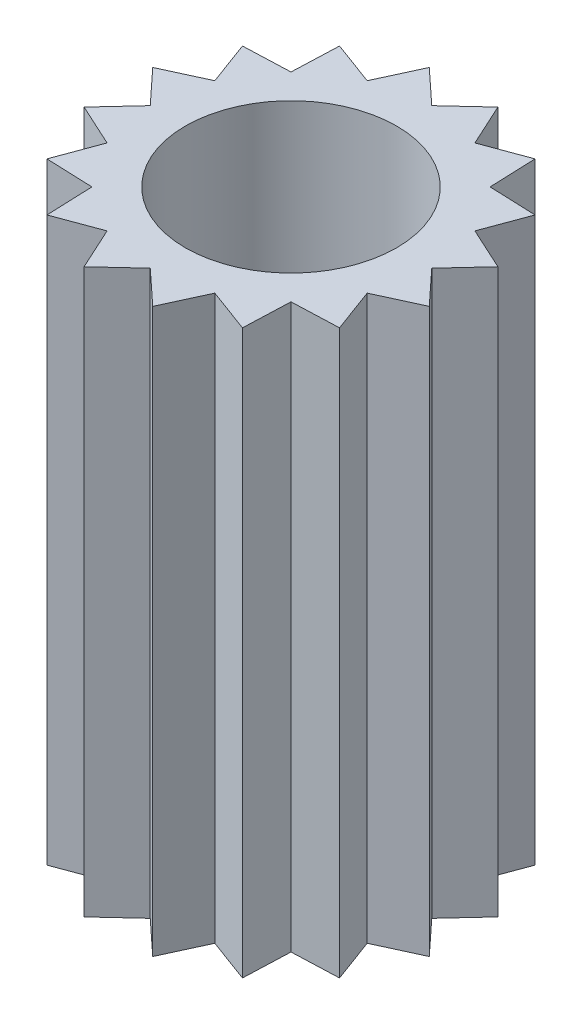
ISO-10303-21;
HEADER;
FILE_DESCRIPTION(('STEP AP214'),'2;1');
FILE_NAME('part.step','',(''),(''),'','','');
FILE_SCHEMA(('AUTOMOTIVE_DESIGN { 1 0 10303 214 1 1 1 1 }'));
ENDSEC;
DATA;
#1=APPLICATION_CONTEXT('core data for automotive mechanical design processes');
#2=APPLICATION_PROTOCOL_DEFINITION('international standard','automotive_design',2000,#1);
#3=PRODUCT_CONTEXT('',#1,'mechanical');
#4=PRODUCT('Part','Part','',(#3));
#5=PRODUCT_RELATED_PRODUCT_CATEGORY('part','',(#4));
#6=PRODUCT_DEFINITION_FORMATION('','',#4);
#7=PRODUCT_DEFINITION_CONTEXT('part definition',#1,'design');
#8=PRODUCT_DEFINITION('design','',#6,#7);
#9=PRODUCT_DEFINITION_SHAPE('','',#8);
#10=(LENGTH_UNIT() NAMED_UNIT(*) SI_UNIT(.MILLI.,.METRE.));
#11=(NAMED_UNIT(*) PLANE_ANGLE_UNIT() SI_UNIT($,.RADIAN.));
#12=(NAMED_UNIT(*) SI_UNIT($,.STERADIAN.) SOLID_ANGLE_UNIT());
#13=UNCERTAINTY_MEASURE_WITH_UNIT(LENGTH_MEASURE(1.E-05),#10,'distance_accuracy_value','');
#14=(GEOMETRIC_REPRESENTATION_CONTEXT(3) GLOBAL_UNCERTAINTY_ASSIGNED_CONTEXT((#13)) GLOBAL_UNIT_ASSIGNED_CONTEXT((#10,
#11,#12)) REPRESENTATION_CONTEXT('',''));
#15=CARTESIAN_POINT('',(0.,0.,0.));
#16=DIRECTION('',(0.,0.,1.));
#17=DIRECTION('',(1.,0.,0.));
#18=AXIS2_PLACEMENT_3D('',#15,#16,#17);
#19=CARTESIAN_POINT('',(0.,8.,0.));
#20=DIRECTION('',(0.,-1.,0.));
#21=DIRECTION('',(0.,0.,-1.));
#22=AXIS2_PLACEMENT_3D('',#19,#20,#21);
#23=PLANE('',#22);
#24=DIRECTION('',(-0.733486790032059,0.,-0.679703706660826));
#25=VECTOR('',#24,1.);
#26=CARTESIAN_POINT('',(-0.487725805040305,8.,-2.45196320100808));
#27=LINE('',#26,#25);
#28=CARTESIAN_POINT('',(0.,8.,-2.));
#29=VERTEX_POINT('',#28);
#30=CARTESIAN_POINT('',(-0.487725805040305,8.,-2.45196320100808));
#31=VERTEX_POINT('',#30);
#32=EDGE_CURVE('E340',#29,#31,#27,.T.);
#33=ORIENTED_EDGE('',*,*,#32,.T.);
#34=DIRECTION('',(-0.417542085221823,0.,0.908657585159895));
#35=VECTOR('',#34,1.);
#36=CARTESIAN_POINT('',(-0.765366864730182,8.,-1.84775906502257));
#37=LINE('',#36,#35);
#38=CARTESIAN_POINT('',(-0.765366864730182,8.,-1.84775906502257));
#39=VERTEX_POINT('',#38);
#40=EDGE_CURVE('E168',#31,#39,#37,.T.);
#41=ORIENTED_EDGE('',*,*,#40,.T.);
#42=DIRECTION('',(-0.937764780134276,0.,-0.347271100352033));
#43=VECTOR('',#42,1.);
#44=CARTESIAN_POINT('',(-1.38892558254902,8.,-2.07867403075635));
#45=LINE('',#44,#43);
#46=CARTESIAN_POINT('',(-1.38892558254902,8.,-2.07867403075635));
#47=VERTEX_POINT('',#46);
#48=EDGE_CURVE('E427',#39,#47,#45,.T.);
#49=ORIENTED_EDGE('',*,*,#48,.T.);
#50=DIRECTION('',(-0.0380303829649199,0.,0.999276583319924));
#51=VECTOR('',#50,1.);
#52=CARTESIAN_POINT('',(-1.4142135623731,8.,-1.41421356237309));
#53=LINE('',#52,#51);
#54=CARTESIAN_POINT('',(-1.4142135623731,8.,-1.41421356237309));
#55=VERTEX_POINT('',#54);
#56=EDGE_CURVE('E446',#47,#55,#53,.T.);
#57=ORIENTED_EDGE('',*,*,#56,.T.);
#58=DIRECTION('',(-0.999276583319923,0.,0.0380303829649601));
#59=VECTOR('',#58,1.);
#60=CARTESIAN_POINT('',(-2.07867403075638,8.,-1.38892558254899));
#61=LINE('',#60,#59);
#62=CARTESIAN_POINT('',(-2.07867403075638,8.,-1.38892558254899));
#63=VERTEX_POINT('',#62);
#64=EDGE_CURVE('E443',#55,#63,#61,.T.);
#65=ORIENTED_EDGE('',*,*,#64,.T.);
#66=DIRECTION('',(0.347271100352073,0.,0.937764780134262));
#67=VECTOR('',#66,1.);
#68=CARTESIAN_POINT('',(-1.84775906502258,8.,-0.765366864730179));
#69=LINE('',#68,#67);
#70=CARTESIAN_POINT('',(-1.84775906502258,8.,-0.765366864730179));
#71=VERTEX_POINT('',#70);
#72=EDGE_CURVE('E445',#63,#71,#69,.T.);
#73=ORIENTED_EDGE('',*,*,#72,.T.);
#74=DIRECTION('',(-0.908657585159895,0.,0.417542085221823));
#75=VECTOR('',#74,1.);
#76=CARTESIAN_POINT('',(-2.45196320100808,8.,-0.487725805040301));
#77=LINE('',#76,#75);
#78=CARTESIAN_POINT('',(-2.45196320100808,8.,-0.487725805040301));
#79=VERTEX_POINT('',#78);
#80=EDGE_CURVE('E448',#71,#79,#77,.T.);
#81=ORIENTED_EDGE('',*,*,#80,.T.);
#82=DIRECTION('',(0.679703706660826,0.,0.733486790032059));
#83=VECTOR('',#82,1.);
#84=CARTESIAN_POINT('',(-2.,8.,0.));
#85=LINE('',#84,#83);
#86=CARTESIAN_POINT('',(-2.,8.,0.));
#87=VERTEX_POINT('',#86);
#88=EDGE_CURVE('E454',#79,#87,#85,.T.);
#89=ORIENTED_EDGE('',*,*,#88,.T.);
#90=DIRECTION('',(-0.679703706660794,0.,0.733486790032088));
#91=VECTOR('',#90,1.);
#92=CARTESIAN_POINT('',(-2.45196320100808,8.,0.487725805040342));
#93=LINE('',#92,#91);
#94=CARTESIAN_POINT('',(-2.45196320100808,8.,0.487725805040342));
#95=VERTEX_POINT('',#94);
#96=EDGE_CURVE('E456',#87,#95,#93,.T.);
#97=ORIENTED_EDGE('',*,*,#96,.T.);
#98=DIRECTION('',(0.908657585159913,0.,0.417542085221783));
#99=VECTOR('',#98,1.);
#100=CARTESIAN_POINT('',(-1.84775906502258,8.,0.765366864730184));
#101=LINE('',#100,#99);
#102=CARTESIAN_POINT('',(-1.84775906502258,8.,0.765366864730184));
#103=VERTEX_POINT('',#102);
#104=EDGE_CURVE('E458',#95,#103,#101,.T.);
#105=ORIENTED_EDGE('',*,*,#104,.T.);
#106=DIRECTION('',(-0.347271100352034,0.,0.937764780134276));
#107=VECTOR('',#106,1.);
#108=CARTESIAN_POINT('',(-2.07867403075636,8.,1.38892558254902));
#109=LINE('',#108,#107);
#110=CARTESIAN_POINT('',(-2.07867403075636,8.,1.38892558254902));
#111=VERTEX_POINT('',#110);
#112=EDGE_CURVE('E460',#103,#111,#109,.T.);
#113=ORIENTED_EDGE('',*,*,#112,.T.);
#114=DIRECTION('',(0.999276583319924,0.,0.0380303829649199));
#115=VECTOR('',#114,1.);
#116=CARTESIAN_POINT('',(-1.4142135623731,8.,1.4142135623731));
#117=LINE('',#116,#115);
#118=CARTESIAN_POINT('',(-1.4142135623731,8.,1.4142135623731));
#119=VERTEX_POINT('',#118);
#120=EDGE_CURVE('E462',#111,#119,#117,.T.);
#121=ORIENTED_EDGE('',*,*,#120,.T.);
#122=DIRECTION('',(0.0380303829649621,0.,0.999276583319923));
#123=VECTOR('',#122,1.);
#124=CARTESIAN_POINT('',(-1.38892558254899,8.,2.07867403075638));
#125=LINE('',#124,#123);
#126=CARTESIAN_POINT('',(-1.38892558254899,8.,2.07867403075638));
#127=VERTEX_POINT('',#126);
#128=EDGE_CURVE('E464',#119,#127,#125,.T.);
#129=ORIENTED_EDGE('',*,*,#128,.T.);
#130=DIRECTION('',(0.937764780134262,0.,-0.347271100352073));
#131=VECTOR('',#130,1.);
#132=CARTESIAN_POINT('',(-0.765366864730182,8.,1.84775906502258));
#133=LINE('',#132,#131);
#134=CARTESIAN_POINT('',(-0.765366864730182,8.,1.84775906502258));
#135=VERTEX_POINT('',#134);
#136=EDGE_CURVE('E466',#127,#135,#133,.T.);
#137=ORIENTED_EDGE('',*,*,#136,.T.);
#138=DIRECTION('',(0.417542085221822,0.,0.908657585159896));
#139=VECTOR('',#138,1.);
#140=CARTESIAN_POINT('',(-0.487725805040306,8.,2.45196320100809));
#141=LINE('',#140,#139);
#142=CARTESIAN_POINT('',(-0.487725805040306,8.,2.45196320100809));
#143=VERTEX_POINT('',#142);
#144=EDGE_CURVE('E468',#135,#143,#141,.T.);
#145=ORIENTED_EDGE('',*,*,#144,.T.);
#146=DIRECTION('',(0.733486790032059,0.,-0.679703706660827));
#147=VECTOR('',#146,1.);
#148=CARTESIAN_POINT('',(0.,8.,2.00000000000001));
#149=LINE('',#148,#147);
#150=CARTESIAN_POINT('',(0.,8.,2.00000000000001));
#151=VERTEX_POINT('',#150);
#152=EDGE_CURVE('E470',#143,#151,#149,.T.);
#153=ORIENTED_EDGE('',*,*,#152,.T.);
#154=DIRECTION('',(0.733486790032087,0.,0.679703706660796));
#155=VECTOR('',#154,1.);
#156=CARTESIAN_POINT('',(0.487725805040337,8.,2.45196320100808));
#157=LINE('',#156,#155);
#158=CARTESIAN_POINT('',(0.487725805040337,8.,2.45196320100808));
#159=VERTEX_POINT('',#158);
#160=EDGE_CURVE('E472',#151,#159,#157,.T.);
#161=ORIENTED_EDGE('',*,*,#160,.T.);
#162=DIRECTION('',(0.417542085221784,0.,-0.908657585159913));
#163=VECTOR('',#162,1.);
#164=CARTESIAN_POINT('',(0.765366864730179,8.,1.84775906502258));
#165=LINE('',#164,#163);
#166=CARTESIAN_POINT('',(0.765366864730179,8.,1.84775906502258));
#167=VERTEX_POINT('',#166);
#168=EDGE_CURVE('E474',#159,#167,#165,.T.);
#169=ORIENTED_EDGE('',*,*,#168,.T.);
#170=DIRECTION('',(0.937764780134277,0.,0.347271100352033));
#171=VECTOR('',#170,1.);
#172=CARTESIAN_POINT('',(1.38892558254902,8.,2.07867403075636));
#173=LINE('',#172,#171);
#174=CARTESIAN_POINT('',(1.38892558254902,8.,2.07867403075636));
#175=VERTEX_POINT('',#174);
#176=EDGE_CURVE('E476',#167,#175,#173,.T.);
#177=ORIENTED_EDGE('',*,*,#176,.T.);
#178=DIRECTION('',(0.0380303829649199,0.,-0.999276583319924));
#179=VECTOR('',#178,1.);
#180=CARTESIAN_POINT('',(1.4142135623731,8.,1.4142135623731));
#181=LINE('',#180,#179);
#182=CARTESIAN_POINT('',(1.4142135623731,8.,1.4142135623731));
#183=VERTEX_POINT('',#182);
#184=EDGE_CURVE('E478',#175,#183,#181,.T.);
#185=ORIENTED_EDGE('',*,*,#184,.T.);
#186=DIRECTION('',(0.999276583319923,0.,-0.0380303829649618));
#187=VECTOR('',#186,1.);
#188=CARTESIAN_POINT('',(2.07867403075637,8.,1.388925582549));
#189=LINE('',#188,#187);
#190=CARTESIAN_POINT('',(2.07867403075637,8.,1.388925582549));
#191=VERTEX_POINT('',#190);
#192=EDGE_CURVE('E480',#183,#191,#189,.T.);
#193=ORIENTED_EDGE('',*,*,#192,.T.);
#194=DIRECTION('',(-0.347271100352073,0.,-0.937764780134262));
#195=VECTOR('',#194,1.);
#196=CARTESIAN_POINT('',(1.84775906502258,8.,0.765366864730185));
#197=LINE('',#196,#195);
#198=CARTESIAN_POINT('',(1.84775906502258,8.,0.765366864730185));
#199=VERTEX_POINT('',#198);
#200=EDGE_CURVE('E482',#191,#199,#197,.T.);
#201=ORIENTED_EDGE('',*,*,#200,.T.);
#202=DIRECTION('',(0.908657585159896,0.,-0.417542085221822));
#203=VECTOR('',#202,1.);
#204=CARTESIAN_POINT('',(2.45196320100808,8.,0.487725805040308));
#205=LINE('',#204,#203);
#206=CARTESIAN_POINT('',(2.45196320100808,8.,0.487725805040308));
#207=VERTEX_POINT('',#206);
#208=EDGE_CURVE('E484',#199,#207,#205,.T.);
#209=ORIENTED_EDGE('',*,*,#208,.T.);
#210=DIRECTION('',(-0.679703706660827,0.,-0.733486790032059));
#211=VECTOR('',#210,1.);
#212=CARTESIAN_POINT('',(2.,8.,0.));
#213=LINE('',#212,#211);
#214=CARTESIAN_POINT('',(2.,8.,0.));
#215=VERTEX_POINT('',#214);
#216=EDGE_CURVE('E486',#207,#215,#213,.T.);
#217=ORIENTED_EDGE('',*,*,#216,.T.);
#218=DIRECTION('',(0.679703706660795,0.,-0.733486790032087));
#219=VECTOR('',#218,1.);
#220=CARTESIAN_POINT('',(2.45196320100808,8.,-0.487725805040334));
#221=LINE('',#220,#219);
#222=CARTESIAN_POINT('',(2.45196320100808,8.,-0.487725805040334));
#223=VERTEX_POINT('',#222);
#224=EDGE_CURVE('E488',#215,#223,#221,.T.);
#225=ORIENTED_EDGE('',*,*,#224,.T.);
#226=DIRECTION('',(-0.908657585159913,0.,-0.417542085221784));
#227=VECTOR('',#226,1.);
#228=CARTESIAN_POINT('',(1.84775906502258,8.,-0.765366864730177));
#229=LINE('',#228,#227);
#230=CARTESIAN_POINT('',(1.84775906502258,8.,-0.765366864730177));
#231=VERTEX_POINT('',#230);
#232=EDGE_CURVE('E490',#223,#231,#229,.T.);
#233=ORIENTED_EDGE('',*,*,#232,.T.);
#234=DIRECTION('',(0.347271100352034,0.,-0.937764780134276));
#235=VECTOR('',#234,1.);
#236=CARTESIAN_POINT('',(2.07867403075636,8.,-1.38892558254902));
#237=LINE('',#236,#235);
#238=CARTESIAN_POINT('',(2.07867403075636,8.,-1.38892558254902));
#239=VERTEX_POINT('',#238);
#240=EDGE_CURVE('E492',#231,#239,#237,.T.);
#241=ORIENTED_EDGE('',*,*,#240,.T.);
#242=DIRECTION('',(-0.999276583319924,0.,-0.0380303829649199));
#243=VECTOR('',#242,1.);
#244=CARTESIAN_POINT('',(1.4142135623731,8.,-1.41421356237309));
#245=LINE('',#244,#243);
#246=CARTESIAN_POINT('',(1.4142135623731,8.,-1.41421356237309));
#247=VERTEX_POINT('',#246);
#248=EDGE_CURVE('E494',#239,#247,#245,.T.);
#249=ORIENTED_EDGE('',*,*,#248,.T.);
#250=DIRECTION('',(-0.0380303829649624,0.,-0.999276583319923));
#251=VECTOR('',#250,1.);
#252=CARTESIAN_POINT('',(1.38892558254899,8.,-2.07867403075637));
#253=LINE('',#252,#251);
#254=CARTESIAN_POINT('',(1.38892558254899,8.,-2.07867403075637));
#255=VERTEX_POINT('',#254);
#256=EDGE_CURVE('E259',#247,#255,#253,.T.);
#257=ORIENTED_EDGE('',*,*,#256,.T.);
#258=DIRECTION('',(-0.937764780134262,0.,0.347271100352073));
#259=VECTOR('',#258,1.);
#260=CARTESIAN_POINT('',(0.765366864730181,8.,-1.84775906502257));
#261=LINE('',#260,#259);
#262=CARTESIAN_POINT('',(0.765366864730181,8.,-1.84775906502257));
#263=VERTEX_POINT('',#262);
#264=EDGE_CURVE('E253',#255,#263,#261,.T.);
#265=ORIENTED_EDGE('',*,*,#264,.T.);
#266=DIRECTION('',(-0.417542085221823,0.,-0.908657585159895));
#267=VECTOR('',#266,1.);
#268=CARTESIAN_POINT('',(0.487725805040303,8.,-2.45196320100808));
#269=LINE('',#268,#267);
#270=CARTESIAN_POINT('',(0.487725805040303,8.,-2.45196320100808));
#271=VERTEX_POINT('',#270);
#272=EDGE_CURVE('E257',#263,#271,#269,.T.);
#273=ORIENTED_EDGE('',*,*,#272,.T.);
#274=DIRECTION('',(-0.733486790032058,0.,0.679703706660827));
#275=VECTOR('',#274,1.);
#276=CARTESIAN_POINT('',(0.,8.,-2.));
#277=LINE('',#276,#275);
#278=EDGE_CURVE('E53',#271,#29,#277,.T.);
#279=ORIENTED_EDGE('',*,*,#278,.T.);
#280=EDGE_LOOP('',(#33,#41,#49,#57,#65,#73,#81,#89,#97,#105,#113,#121,#129,#137,#145,#153,#161,
#169,#177,#185,#193,#201,#209,#217,#225,#233,#241,#249,#257,#265,#273,#279));
#281=FACE_BOUND('',#280,.T.);
#282=CARTESIAN_POINT('',(0.,8.,0.));
#283=DIRECTION('',(0.,1.,0.));
#284=DIRECTION('',(0.,0.,1.));
#285=AXIS2_PLACEMENT_3D('',#282,#283,#284);
#286=CIRCLE('',#285,1.5);
#287=CARTESIAN_POINT('',(0.,8.,1.5));
#288=VERTEX_POINT('',#287);
#289=EDGE_CURVE('E281',#288,#288,#286,.T.);
#290=ORIENTED_EDGE('',*,*,#289,.F.);
#291=EDGE_LOOP('',(#290));
#292=FACE_BOUND('',#291,.T.);
#293=ADVANCED_FACE('F36',(#281,#292),#23,.F.);
#294=CARTESIAN_POINT('',(0.,0.,0.));
#295=DIRECTION('',(0.,-1.,0.));
#296=DIRECTION('',(0.,0.,-1.));
#297=AXIS2_PLACEMENT_3D('',#294,#295,#296);
#298=PLANE('',#297);
#299=DIRECTION('',(-0.733486790032059,0.,-0.679703706660826));
#300=VECTOR('',#299,1.);
#301=CARTESIAN_POINT('',(-0.487725805040305,0.,-2.45196320100808));
#302=LINE('',#301,#300);
#303=CARTESIAN_POINT('',(0.,0.,-2.));
#304=VERTEX_POINT('',#303);
#305=CARTESIAN_POINT('',(-0.487725805040305,0.,-2.45196320100808));
#306=VERTEX_POINT('',#305);
#307=EDGE_CURVE('E277',#304,#306,#302,.T.);
#308=ORIENTED_EDGE('',*,*,#307,.F.);
#309=DIRECTION('',(-0.733486790032058,0.,0.679703706660827));
#310=VECTOR('',#309,1.);
#311=CARTESIAN_POINT('',(0.,0.,-2.));
#312=LINE('',#311,#310);
#313=CARTESIAN_POINT('',(0.487725805040303,0.,-2.45196320100808));
#314=VERTEX_POINT('',#313);
#315=EDGE_CURVE('E160',#314,#304,#312,.T.);
#316=ORIENTED_EDGE('',*,*,#315,.F.);
#317=DIRECTION('',(-0.417542085221823,0.,-0.908657585159895));
#318=VECTOR('',#317,1.);
#319=CARTESIAN_POINT('',(0.487725805040303,0.,-2.45196320100808));
#320=LINE('',#319,#318);
#321=CARTESIAN_POINT('',(0.765366864730181,0.,-1.84775906502257));
#322=VERTEX_POINT('',#321);
#323=EDGE_CURVE('E154',#322,#314,#320,.T.);
#324=ORIENTED_EDGE('',*,*,#323,.F.);
#325=DIRECTION('',(-0.937764780134262,0.,0.347271100352073));
#326=VECTOR('',#325,1.);
#327=CARTESIAN_POINT('',(0.765366864730181,0.,-1.84775906502257));
#328=LINE('',#327,#326);
#329=CARTESIAN_POINT('',(1.38892558254899,0.,-2.07867403075637));
#330=VERTEX_POINT('',#329);
#331=EDGE_CURVE('E267',#330,#322,#328,.T.);
#332=ORIENTED_EDGE('',*,*,#331,.F.);
#333=DIRECTION('',(-0.0380303829649624,0.,-0.999276583319923));
#334=VECTOR('',#333,1.);
#335=CARTESIAN_POINT('',(1.38892558254899,0.,-2.07867403075637));
#336=LINE('',#335,#334);
#337=CARTESIAN_POINT('',(1.4142135623731,0.,-1.41421356237309));
#338=VERTEX_POINT('',#337);
#339=EDGE_CURVE('E335',#338,#330,#336,.T.);
#340=ORIENTED_EDGE('',*,*,#339,.F.);
#341=DIRECTION('',(-0.999276583319924,0.,-0.0380303829649199));
#342=VECTOR('',#341,1.);
#343=CARTESIAN_POINT('',(1.4142135623731,0.,-1.41421356237309));
#344=LINE('',#343,#342);
#345=CARTESIAN_POINT('',(2.07867403075636,0.,-1.38892558254902));
#346=VERTEX_POINT('',#345);
#347=EDGE_CURVE('E333',#346,#338,#344,.T.);
#348=ORIENTED_EDGE('',*,*,#347,.F.);
#349=DIRECTION('',(0.347271100352034,0.,-0.937764780134276));
#350=VECTOR('',#349,1.);
#351=CARTESIAN_POINT('',(2.07867403075636,0.,-1.38892558254902));
#352=LINE('',#351,#350);
#353=CARTESIAN_POINT('',(1.84775906502258,0.,-0.765366864730177));
#354=VERTEX_POINT('',#353);
#355=EDGE_CURVE('E331',#354,#346,#352,.T.);
#356=ORIENTED_EDGE('',*,*,#355,.F.);
#357=DIRECTION('',(-0.908657585159913,0.,-0.417542085221784));
#358=VECTOR('',#357,1.);
#359=CARTESIAN_POINT('',(1.84775906502258,0.,-0.765366864730177));
#360=LINE('',#359,#358);
#361=CARTESIAN_POINT('',(2.45196320100808,0.,-0.487725805040334));
#362=VERTEX_POINT('',#361);
#363=EDGE_CURVE('E329',#362,#354,#360,.T.);
#364=ORIENTED_EDGE('',*,*,#363,.F.);
#365=DIRECTION('',(0.679703706660795,0.,-0.733486790032087));
#366=VECTOR('',#365,1.);
#367=CARTESIAN_POINT('',(2.45196320100808,0.,-0.487725805040334));
#368=LINE('',#367,#366);
#369=CARTESIAN_POINT('',(2.,0.,0.));
#370=VERTEX_POINT('',#369);
#371=EDGE_CURVE('E327',#370,#362,#368,.T.);
#372=ORIENTED_EDGE('',*,*,#371,.F.);
#373=DIRECTION('',(-0.679703706660827,0.,-0.733486790032059));
#374=VECTOR('',#373,1.);
#375=CARTESIAN_POINT('',(2.,0.,0.));
#376=LINE('',#375,#374);
#377=CARTESIAN_POINT('',(2.45196320100808,0.,0.487725805040308));
#378=VERTEX_POINT('',#377);
#379=EDGE_CURVE('E325',#378,#370,#376,.T.);
#380=ORIENTED_EDGE('',*,*,#379,.F.);
#381=DIRECTION('',(0.908657585159896,0.,-0.417542085221822));
#382=VECTOR('',#381,1.);
#383=CARTESIAN_POINT('',(2.45196320100808,0.,0.487725805040308));
#384=LINE('',#383,#382);
#385=CARTESIAN_POINT('',(1.84775906502258,0.,0.765366864730185));
#386=VERTEX_POINT('',#385);
#387=EDGE_CURVE('E323',#386,#378,#384,.T.);
#388=ORIENTED_EDGE('',*,*,#387,.F.);
#389=DIRECTION('',(-0.347271100352073,0.,-0.937764780134262));
#390=VECTOR('',#389,1.);
#391=CARTESIAN_POINT('',(1.84775906502258,0.,0.765366864730185));
#392=LINE('',#391,#390);
#393=CARTESIAN_POINT('',(2.07867403075637,0.,1.388925582549));
#394=VERTEX_POINT('',#393);
#395=EDGE_CURVE('E321',#394,#386,#392,.T.);
#396=ORIENTED_EDGE('',*,*,#395,.F.);
#397=DIRECTION('',(0.999276583319923,0.,-0.0380303829649618));
#398=VECTOR('',#397,1.);
#399=CARTESIAN_POINT('',(2.07867403075637,0.,1.388925582549));
#400=LINE('',#399,#398);
#401=CARTESIAN_POINT('',(1.4142135623731,0.,1.4142135623731));
#402=VERTEX_POINT('',#401);
#403=EDGE_CURVE('E319',#402,#394,#400,.T.);
#404=ORIENTED_EDGE('',*,*,#403,.F.);
#405=DIRECTION('',(0.0380303829649199,0.,-0.999276583319924));
#406=VECTOR('',#405,1.);
#407=CARTESIAN_POINT('',(1.4142135623731,0.,1.4142135623731));
#408=LINE('',#407,#406);
#409=CARTESIAN_POINT('',(1.38892558254902,0.,2.07867403075636));
#410=VERTEX_POINT('',#409);
#411=EDGE_CURVE('E317',#410,#402,#408,.T.);
#412=ORIENTED_EDGE('',*,*,#411,.F.);
#413=DIRECTION('',(0.937764780134277,0.,0.347271100352033));
#414=VECTOR('',#413,1.);
#415=CARTESIAN_POINT('',(1.38892558254902,0.,2.07867403075636));
#416=LINE('',#415,#414);
#417=CARTESIAN_POINT('',(0.765366864730179,0.,1.84775906502258));
#418=VERTEX_POINT('',#417);
#419=EDGE_CURVE('E315',#418,#410,#416,.T.);
#420=ORIENTED_EDGE('',*,*,#419,.F.);
#421=DIRECTION('',(0.417542085221784,0.,-0.908657585159913));
#422=VECTOR('',#421,1.);
#423=CARTESIAN_POINT('',(0.765366864730179,0.,1.84775906502258));
#424=LINE('',#423,#422);
#425=CARTESIAN_POINT('',(0.487725805040337,0.,2.45196320100808));
#426=VERTEX_POINT('',#425);
#427=EDGE_CURVE('E313',#426,#418,#424,.T.);
#428=ORIENTED_EDGE('',*,*,#427,.F.);
#429=DIRECTION('',(0.733486790032087,0.,0.679703706660796));
#430=VECTOR('',#429,1.);
#431=CARTESIAN_POINT('',(0.487725805040337,0.,2.45196320100808));
#432=LINE('',#431,#430);
#433=CARTESIAN_POINT('',(0.,0.,2.00000000000001));
#434=VERTEX_POINT('',#433);
#435=EDGE_CURVE('E311',#434,#426,#432,.T.);
#436=ORIENTED_EDGE('',*,*,#435,.F.);
#437=DIRECTION('',(0.733486790032059,0.,-0.679703706660827));
#438=VECTOR('',#437,1.);
#439=CARTESIAN_POINT('',(0.,0.,2.00000000000001));
#440=LINE('',#439,#438);
#441=CARTESIAN_POINT('',(-0.487725805040306,0.,2.45196320100809));
#442=VERTEX_POINT('',#441);
#443=EDGE_CURVE('E309',#442,#434,#440,.T.);
#444=ORIENTED_EDGE('',*,*,#443,.F.);
#445=DIRECTION('',(0.417542085221822,0.,0.908657585159896));
#446=VECTOR('',#445,1.);
#447=CARTESIAN_POINT('',(-0.487725805040306,0.,2.45196320100809));
#448=LINE('',#447,#446);
#449=CARTESIAN_POINT('',(-0.765366864730182,0.,1.84775906502258));
#450=VERTEX_POINT('',#449);
#451=EDGE_CURVE('E307',#450,#442,#448,.T.);
#452=ORIENTED_EDGE('',*,*,#451,.F.);
#453=DIRECTION('',(0.937764780134262,0.,-0.347271100352073));
#454=VECTOR('',#453,1.);
#455=CARTESIAN_POINT('',(-0.765366864730182,0.,1.84775906502258));
#456=LINE('',#455,#454);
#457=CARTESIAN_POINT('',(-1.38892558254899,0.,2.07867403075638));
#458=VERTEX_POINT('',#457);
#459=EDGE_CURVE('E305',#458,#450,#456,.T.);
#460=ORIENTED_EDGE('',*,*,#459,.F.);
#461=DIRECTION('',(0.0380303829649621,0.,0.999276583319923));
#462=VECTOR('',#461,1.);
#463=CARTESIAN_POINT('',(-1.38892558254899,0.,2.07867403075638));
#464=LINE('',#463,#462);
#465=CARTESIAN_POINT('',(-1.4142135623731,0.,1.4142135623731));
#466=VERTEX_POINT('',#465);
#467=EDGE_CURVE('E303',#466,#458,#464,.T.);
#468=ORIENTED_EDGE('',*,*,#467,.F.);
#469=DIRECTION('',(0.999276583319924,0.,0.0380303829649199));
#470=VECTOR('',#469,1.);
#471=CARTESIAN_POINT('',(-1.4142135623731,0.,1.4142135623731));
#472=LINE('',#471,#470);
#473=CARTESIAN_POINT('',(-2.07867403075636,0.,1.38892558254902));
#474=VERTEX_POINT('',#473);
#475=EDGE_CURVE('E301',#474,#466,#472,.T.);
#476=ORIENTED_EDGE('',*,*,#475,.F.);
#477=DIRECTION('',(-0.347271100352034,0.,0.937764780134276));
#478=VECTOR('',#477,1.);
#479=CARTESIAN_POINT('',(-2.07867403075636,0.,1.38892558254902));
#480=LINE('',#479,#478);
#481=CARTESIAN_POINT('',(-1.84775906502258,0.,0.765366864730184));
#482=VERTEX_POINT('',#481);
#483=EDGE_CURVE('E299',#482,#474,#480,.T.);
#484=ORIENTED_EDGE('',*,*,#483,.F.);
#485=DIRECTION('',(0.908657585159913,0.,0.417542085221783));
#486=VECTOR('',#485,1.);
#487=CARTESIAN_POINT('',(-1.84775906502258,0.,0.765366864730184));
#488=LINE('',#487,#486);
#489=CARTESIAN_POINT('',(-2.45196320100808,0.,0.487725805040342));
#490=VERTEX_POINT('',#489);
#491=EDGE_CURVE('E297',#490,#482,#488,.T.);
#492=ORIENTED_EDGE('',*,*,#491,.F.);
#493=DIRECTION('',(-0.679703706660794,0.,0.733486790032088));
#494=VECTOR('',#493,1.);
#495=CARTESIAN_POINT('',(-2.45196320100808,0.,0.487725805040342));
#496=LINE('',#495,#494);
#497=CARTESIAN_POINT('',(-2.,0.,0.));
#498=VERTEX_POINT('',#497);
#499=EDGE_CURVE('E295',#498,#490,#496,.T.);
#500=ORIENTED_EDGE('',*,*,#499,.F.);
#501=DIRECTION('',(0.679703706660826,0.,0.733486790032059));
#502=VECTOR('',#501,1.);
#503=CARTESIAN_POINT('',(-2.,0.,0.));
#504=LINE('',#503,#502);
#505=CARTESIAN_POINT('',(-2.45196320100808,0.,-0.487725805040301));
#506=VERTEX_POINT('',#505);
#507=EDGE_CURVE('E293',#506,#498,#504,.T.);
#508=ORIENTED_EDGE('',*,*,#507,.F.);
#509=DIRECTION('',(-0.908657585159895,0.,0.417542085221823));
#510=VECTOR('',#509,1.);
#511=CARTESIAN_POINT('',(-2.45196320100808,0.,-0.487725805040301));
#512=LINE('',#511,#510);
#513=CARTESIAN_POINT('',(-1.84775906502258,0.,-0.765366864730179));
#514=VERTEX_POINT('',#513);
#515=EDGE_CURVE('E291',#514,#506,#512,.T.);
#516=ORIENTED_EDGE('',*,*,#515,.F.);
#517=DIRECTION('',(0.347271100352073,0.,0.937764780134262));
#518=VECTOR('',#517,1.);
#519=CARTESIAN_POINT('',(-1.84775906502258,0.,-0.765366864730179));
#520=LINE('',#519,#518);
#521=CARTESIAN_POINT('',(-2.07867403075638,0.,-1.38892558254899));
#522=VERTEX_POINT('',#521);
#523=EDGE_CURVE('E289',#522,#514,#520,.T.);
#524=ORIENTED_EDGE('',*,*,#523,.F.);
#525=DIRECTION('',(-0.999276583319923,0.,0.0380303829649601));
#526=VECTOR('',#525,1.);
#527=CARTESIAN_POINT('',(-2.07867403075638,0.,-1.38892558254899));
#528=LINE('',#527,#526);
#529=CARTESIAN_POINT('',(-1.4142135623731,0.,-1.41421356237309));
#530=VERTEX_POINT('',#529);
#531=EDGE_CURVE('E287',#530,#522,#528,.T.);
#532=ORIENTED_EDGE('',*,*,#531,.F.);
#533=DIRECTION('',(-0.0380303829649199,0.,0.999276583319924));
#534=VECTOR('',#533,1.);
#535=CARTESIAN_POINT('',(-1.4142135623731,0.,-1.41421356237309));
#536=LINE('',#535,#534);
#537=CARTESIAN_POINT('',(-1.38892558254902,0.,-2.07867403075635));
#538=VERTEX_POINT('',#537);
#539=EDGE_CURVE('E285',#538,#530,#536,.T.);
#540=ORIENTED_EDGE('',*,*,#539,.F.);
#541=DIRECTION('',(-0.937764780134276,0.,-0.347271100352033));
#542=VECTOR('',#541,1.);
#543=CARTESIAN_POINT('',(-1.38892558254902,0.,-2.07867403075635));
#544=LINE('',#543,#542);
#545=CARTESIAN_POINT('',(-0.765366864730182,0.,-1.84775906502257));
#546=VERTEX_POINT('',#545);
#547=EDGE_CURVE('E283',#546,#538,#544,.T.);
#548=ORIENTED_EDGE('',*,*,#547,.F.);
#549=DIRECTION('',(-0.417542085221823,0.,0.908657585159895));
#550=VECTOR('',#549,1.);
#551=CARTESIAN_POINT('',(-0.765366864730182,0.,-1.84775906502257));
#552=LINE('',#551,#550);
#553=EDGE_CURVE('E280',#306,#546,#552,.T.);
#554=ORIENTED_EDGE('',*,*,#553,.F.);
#555=EDGE_LOOP('',(#308,#316,#324,#332,#340,#348,#356,#364,#372,#380,#388,#396,#404,#412,#420,
#428,#436,#444,#452,#460,#468,#476,#484,#492,#500,#508,#516,#524,#532,#540,#548,#554));
#556=FACE_BOUND('',#555,.T.);
#557=CARTESIAN_POINT('',(0.,0.,0.));
#558=DIRECTION('',(0.,1.,0.));
#559=DIRECTION('',(0.,0.,1.));
#560=AXIS2_PLACEMENT_3D('',#557,#558,#559);
#561=CIRCLE('',#560,1.5);
#562=CARTESIAN_POINT('',(0.,0.,1.5));
#563=VERTEX_POINT('',#562);
#564=EDGE_CURVE('E901',#563,#563,#561,.T.);
#565=ORIENTED_EDGE('',*,*,#564,.T.);
#566=EDGE_LOOP('',(#565));
#567=FACE_BOUND('',#566,.T.);
#568=ADVANCED_FACE('F431',(#556,#567),#298,.T.);
#569=CARTESIAN_POINT('',(-0.487725805040305,8.,-2.45196320100808));
#570=DIRECTION('',(-0.679703706660826,0.,0.733486790032059));
#571=DIRECTION('',(0.733486790032059,0.,0.679703706660826));
#572=AXIS2_PLACEMENT_3D('',#569,#570,#571);
#573=PLANE('',#572);
#574=ORIENTED_EDGE('',*,*,#307,.T.);
#575=DIRECTION('',(0.,-1.,0.));
#576=VECTOR('',#575,1.);
#577=CARTESIAN_POINT('',(-0.487725805040305,8.,-2.45196320100808));
#578=LINE('',#577,#576);
#579=EDGE_CURVE('E11',#31,#306,#578,.T.);
#580=ORIENTED_EDGE('',*,*,#579,.F.);
#581=ORIENTED_EDGE('',*,*,#32,.F.);
#582=DIRECTION('',(0.,-1.,0.));
#583=VECTOR('',#582,1.);
#584=CARTESIAN_POINT('',(0.,8.,-2.));
#585=LINE('',#584,#583);
#586=EDGE_CURVE('E273',#29,#304,#585,.T.);
#587=ORIENTED_EDGE('',*,*,#586,.T.);
#588=EDGE_LOOP('',(#574,#580,#581,#587));
#589=FACE_BOUND('',#588,.T.);
#590=ADVANCED_FACE('F38',(#589),#573,.F.);
#591=CARTESIAN_POINT('',(-0.765366864730182,8.,-1.84775906502257));
#592=DIRECTION('',(0.908657585159895,0.,0.417542085221823));
#593=DIRECTION('',(0.417542085221823,0.,-0.908657585159895));
#594=AXIS2_PLACEMENT_3D('',#591,#592,#593);
#595=PLANE('',#594);
#596=ORIENTED_EDGE('',*,*,#553,.T.);
#597=DIRECTION('',(0.,-1.,0.));
#598=VECTOR('',#597,1.);
#599=CARTESIAN_POINT('',(-0.765366864730182,8.,-1.84775906502257));
#600=LINE('',#599,#598);
#601=EDGE_CURVE('E45',#39,#546,#600,.T.);
#602=ORIENTED_EDGE('',*,*,#601,.F.);
#603=ORIENTED_EDGE('',*,*,#40,.F.);
#604=ORIENTED_EDGE('',*,*,#579,.T.);
#605=EDGE_LOOP('',(#596,#602,#603,#604));
#606=FACE_BOUND('',#605,.T.);
#607=ADVANCED_FACE('F528',(#606),#595,.F.);
#608=CARTESIAN_POINT('',(-1.38892558254902,8.,-2.07867403075635));
#609=DIRECTION('',(-0.347271100352033,0.,0.937764780134277));
#610=DIRECTION('',(0.937764780134277,0.,0.347271100352033));
#611=AXIS2_PLACEMENT_3D('',#608,#609,#610);
#612=PLANE('',#611);
#613=ORIENTED_EDGE('',*,*,#547,.T.);
#614=DIRECTION('',(0.,-1.,0.));
#615=VECTOR('',#614,1.);
#616=CARTESIAN_POINT('',(-1.38892558254902,8.,-2.07867403075635));
#617=LINE('',#616,#615);
#618=EDGE_CURVE('E419',#47,#538,#617,.T.);
#619=ORIENTED_EDGE('',*,*,#618,.F.);
#620=ORIENTED_EDGE('',*,*,#48,.F.);
#621=ORIENTED_EDGE('',*,*,#601,.T.);
#622=EDGE_LOOP('',(#613,#619,#620,#621));
#623=FACE_BOUND('',#622,.T.);
#624=ADVANCED_FACE('F425',(#623),#612,.F.);
#625=CARTESIAN_POINT('',(-1.4142135623731,8.,-1.41421356237309));
#626=DIRECTION('',(0.999276583319924,0.,0.0380303829649199));
#627=DIRECTION('',(0.0380303829649199,0.,-0.999276583319924));
#628=AXIS2_PLACEMENT_3D('',#625,#626,#627);
#629=PLANE('',#628);
#630=ORIENTED_EDGE('',*,*,#539,.T.);
#631=DIRECTION('',(0.,-1.,0.));
#632=VECTOR('',#631,1.);
#633=CARTESIAN_POINT('',(-1.4142135623731,8.,-1.41421356237309));
#634=LINE('',#633,#632);
#635=EDGE_CURVE('E416',#55,#530,#634,.T.);
#636=ORIENTED_EDGE('',*,*,#635,.F.);
#637=ORIENTED_EDGE('',*,*,#56,.F.);
#638=ORIENTED_EDGE('',*,*,#618,.T.);
#639=EDGE_LOOP('',(#630,#636,#637,#638));
#640=FACE_BOUND('',#639,.T.);
#641=ADVANCED_FACE('F437',(#640),#629,.F.);
#642=CARTESIAN_POINT('',(-2.07867403075638,8.,-1.38892558254899));
#643=DIRECTION('',(0.0380303829649601,0.,0.999276583319923));
#644=DIRECTION('',(0.999276583319923,0.,-0.0380303829649601));
#645=AXIS2_PLACEMENT_3D('',#642,#643,#644);
#646=PLANE('',#645);
#647=ORIENTED_EDGE('',*,*,#531,.T.);
#648=DIRECTION('',(0.,-1.,0.));
#649=VECTOR('',#648,1.);
#650=CARTESIAN_POINT('',(-2.07867403075638,8.,-1.38892558254899));
#651=LINE('',#650,#649);
#652=EDGE_CURVE('E413',#63,#522,#651,.T.);
#653=ORIENTED_EDGE('',*,*,#652,.F.);
#654=ORIENTED_EDGE('',*,*,#64,.F.);
#655=ORIENTED_EDGE('',*,*,#635,.T.);
#656=EDGE_LOOP('',(#647,#653,#654,#655));
#657=FACE_BOUND('',#656,.T.);
#658=ADVANCED_FACE('F441',(#657),#646,.F.);
#659=CARTESIAN_POINT('',(-1.84775906502258,8.,-0.765366864730179));
#660=DIRECTION('',(0.937764780134262,0.,-0.347271100352073));
#661=DIRECTION('',(-0.347271100352073,0.,-0.937764780134262));
#662=AXIS2_PLACEMENT_3D('',#659,#660,#661);
#663=PLANE('',#662);
#664=ORIENTED_EDGE('',*,*,#523,.T.);
#665=DIRECTION('',(0.,-1.,0.));
#666=VECTOR('',#665,1.);
#667=CARTESIAN_POINT('',(-1.84775906502258,8.,-0.765366864730179));
#668=LINE('',#667,#666);
#669=EDGE_CURVE('E410',#71,#514,#668,.T.);
#670=ORIENTED_EDGE('',*,*,#669,.F.);
#671=ORIENTED_EDGE('',*,*,#72,.F.);
#672=ORIENTED_EDGE('',*,*,#652,.T.);
#673=EDGE_LOOP('',(#664,#670,#671,#672));
#674=FACE_BOUND('',#673,.T.);
#675=ADVANCED_FACE('F541',(#674),#663,.F.);
#676=CARTESIAN_POINT('',(-2.45196320100808,8.,-0.487725805040301));
#677=DIRECTION('',(0.417542085221823,0.,0.908657585159895));
#678=DIRECTION('',(0.908657585159895,0.,-0.417542085221823));
#679=AXIS2_PLACEMENT_3D('',#676,#677,#678);
#680=PLANE('',#679);
#681=ORIENTED_EDGE('',*,*,#515,.T.);
#682=DIRECTION('',(0.,-1.,0.));
#683=VECTOR('',#682,1.);
#684=CARTESIAN_POINT('',(-2.45196320100808,8.,-0.487725805040301));
#685=LINE('',#684,#683);
#686=EDGE_CURVE('E407',#79,#506,#685,.T.);
#687=ORIENTED_EDGE('',*,*,#686,.F.);
#688=ORIENTED_EDGE('',*,*,#80,.F.);
#689=ORIENTED_EDGE('',*,*,#669,.T.);
#690=EDGE_LOOP('',(#681,#687,#688,#689));
#691=FACE_BOUND('',#690,.T.);
#692=ADVANCED_FACE('F544',(#691),#680,.F.);
#693=CARTESIAN_POINT('',(-2.,8.,0.));
#694=DIRECTION('',(0.733486790032059,0.,-0.679703706660826));
#695=DIRECTION('',(-0.679703706660826,0.,-0.733486790032059));
#696=AXIS2_PLACEMENT_3D('',#693,#694,#695);
#697=PLANE('',#696);
#698=ORIENTED_EDGE('',*,*,#507,.T.);
#699=DIRECTION('',(0.,-1.,0.));
#700=VECTOR('',#699,1.);
#701=CARTESIAN_POINT('',(-2.,8.,0.));
#702=LINE('',#701,#700);
#703=EDGE_CURVE('E404',#87,#498,#702,.T.);
#704=ORIENTED_EDGE('',*,*,#703,.F.);
#705=ORIENTED_EDGE('',*,*,#88,.F.);
#706=ORIENTED_EDGE('',*,*,#686,.T.);
#707=EDGE_LOOP('',(#698,#704,#705,#706));
#708=FACE_BOUND('',#707,.T.);
#709=ADVANCED_FACE('F548',(#708),#697,.F.);
#710=CARTESIAN_POINT('',(-2.45196320100808,8.,0.487725805040342));
#711=DIRECTION('',(0.733486790032088,0.,0.679703706660794));
#712=DIRECTION('',(0.679703706660794,0.,-0.733486790032088));
#713=AXIS2_PLACEMENT_3D('',#710,#711,#712);
#714=PLANE('',#713);
#715=ORIENTED_EDGE('',*,*,#499,.T.);
#716=DIRECTION('',(0.,-1.,0.));
#717=VECTOR('',#716,1.);
#718=CARTESIAN_POINT('',(-2.45196320100808,8.,0.487725805040342));
#719=LINE('',#718,#717);
#720=EDGE_CURVE('E401',#95,#490,#719,.T.);
#721=ORIENTED_EDGE('',*,*,#720,.F.);
#722=ORIENTED_EDGE('',*,*,#96,.F.);
#723=ORIENTED_EDGE('',*,*,#703,.T.);
#724=EDGE_LOOP('',(#715,#721,#722,#723));
#725=FACE_BOUND('',#724,.T.);
#726=ADVANCED_FACE('F552',(#725),#714,.F.);
#727=CARTESIAN_POINT('',(-1.84775906502258,8.,0.765366864730184));
#728=DIRECTION('',(0.417542085221783,0.,-0.908657585159913));
#729=DIRECTION('',(-0.908657585159913,0.,-0.417542085221783));
#730=AXIS2_PLACEMENT_3D('',#727,#728,#729);
#731=PLANE('',#730);
#732=ORIENTED_EDGE('',*,*,#491,.T.);
#733=DIRECTION('',(0.,-1.,0.));
#734=VECTOR('',#733,1.);
#735=CARTESIAN_POINT('',(-1.84775906502258,8.,0.765366864730184));
#736=LINE('',#735,#734);
#737=EDGE_CURVE('E398',#103,#482,#736,.T.);
#738=ORIENTED_EDGE('',*,*,#737,.F.);
#739=ORIENTED_EDGE('',*,*,#104,.F.);
#740=ORIENTED_EDGE('',*,*,#720,.T.);
#741=EDGE_LOOP('',(#732,#738,#739,#740));
#742=FACE_BOUND('',#741,.T.);
#743=ADVANCED_FACE('F556',(#742),#731,.F.);
#744=CARTESIAN_POINT('',(-2.07867403075636,8.,1.38892558254902));
#745=DIRECTION('',(0.937764780134276,0.,0.347271100352034));
#746=DIRECTION('',(0.347271100352034,0.,-0.937764780134276));
#747=AXIS2_PLACEMENT_3D('',#744,#745,#746);
#748=PLANE('',#747);
#749=ORIENTED_EDGE('',*,*,#483,.T.);
#750=DIRECTION('',(0.,-1.,0.));
#751=VECTOR('',#750,1.);
#752=CARTESIAN_POINT('',(-2.07867403075636,8.,1.38892558254902));
#753=LINE('',#752,#751);
#754=EDGE_CURVE('E395',#111,#474,#753,.T.);
#755=ORIENTED_EDGE('',*,*,#754,.F.);
#756=ORIENTED_EDGE('',*,*,#112,.F.);
#757=ORIENTED_EDGE('',*,*,#737,.T.);
#758=EDGE_LOOP('',(#749,#755,#756,#757));
#759=FACE_BOUND('',#758,.T.);
#760=ADVANCED_FACE('F560',(#759),#748,.F.);
#761=CARTESIAN_POINT('',(-1.4142135623731,8.,1.4142135623731));
#762=DIRECTION('',(0.0380303829649199,0.,-0.999276583319924));
#763=DIRECTION('',(-0.999276583319924,0.,-0.0380303829649199));
#764=AXIS2_PLACEMENT_3D('',#761,#762,#763);
#765=PLANE('',#764);
#766=ORIENTED_EDGE('',*,*,#475,.T.);
#767=DIRECTION('',(0.,-1.,0.));
#768=VECTOR('',#767,1.);
#769=CARTESIAN_POINT('',(-1.4142135623731,8.,1.4142135623731));
#770=LINE('',#769,#768);
#771=EDGE_CURVE('E392',#119,#466,#770,.T.);
#772=ORIENTED_EDGE('',*,*,#771,.F.);
#773=ORIENTED_EDGE('',*,*,#120,.F.);
#774=ORIENTED_EDGE('',*,*,#754,.T.);
#775=EDGE_LOOP('',(#766,#772,#773,#774));
#776=FACE_BOUND('',#775,.T.);
#777=ADVANCED_FACE('F564',(#776),#765,.F.);
#778=CARTESIAN_POINT('',(-1.38892558254899,8.,2.07867403075638));
#779=DIRECTION('',(0.999276583319923,0.,-0.0380303829649621));
#780=DIRECTION('',(-0.0380303829649621,0.,-0.999276583319923));
#781=AXIS2_PLACEMENT_3D('',#778,#779,#780);
#782=PLANE('',#781);
#783=ORIENTED_EDGE('',*,*,#467,.T.);
#784=DIRECTION('',(0.,-1.,0.));
#785=VECTOR('',#784,1.);
#786=CARTESIAN_POINT('',(-1.38892558254899,8.,2.07867403075638));
#787=LINE('',#786,#785);
#788=EDGE_CURVE('E389',#127,#458,#787,.T.);
#789=ORIENTED_EDGE('',*,*,#788,.F.);
#790=ORIENTED_EDGE('',*,*,#128,.F.);
#791=ORIENTED_EDGE('',*,*,#771,.T.);
#792=EDGE_LOOP('',(#783,#789,#790,#791));
#793=FACE_BOUND('',#792,.T.);
#794=ADVANCED_FACE('F568',(#793),#782,.F.);
#795=CARTESIAN_POINT('',(-0.765366864730182,8.,1.84775906502258));
#796=DIRECTION('',(-0.347271100352073,0.,-0.937764780134262));
#797=DIRECTION('',(-0.937764780134262,0.,0.347271100352073));
#798=AXIS2_PLACEMENT_3D('',#795,#796,#797);
#799=PLANE('',#798);
#800=ORIENTED_EDGE('',*,*,#459,.T.);
#801=DIRECTION('',(0.,-1.,0.));
#802=VECTOR('',#801,1.);
#803=CARTESIAN_POINT('',(-0.765366864730182,8.,1.84775906502258));
#804=LINE('',#803,#802);
#805=EDGE_CURVE('E386',#135,#450,#804,.T.);
#806=ORIENTED_EDGE('',*,*,#805,.F.);
#807=ORIENTED_EDGE('',*,*,#136,.F.);
#808=ORIENTED_EDGE('',*,*,#788,.T.);
#809=EDGE_LOOP('',(#800,#806,#807,#808));
#810=FACE_BOUND('',#809,.T.);
#811=ADVANCED_FACE('F572',(#810),#799,.F.);
#812=CARTESIAN_POINT('',(-0.487725805040306,8.,2.45196320100809));
#813=DIRECTION('',(0.908657585159896,0.,-0.417542085221822));
#814=DIRECTION('',(-0.417542085221822,0.,-0.908657585159896));
#815=AXIS2_PLACEMENT_3D('',#812,#813,#814);
#816=PLANE('',#815);
#817=ORIENTED_EDGE('',*,*,#451,.T.);
#818=DIRECTION('',(0.,-1.,0.));
#819=VECTOR('',#818,1.);
#820=CARTESIAN_POINT('',(-0.487725805040306,8.,2.45196320100809));
#821=LINE('',#820,#819);
#822=EDGE_CURVE('E383',#143,#442,#821,.T.);
#823=ORIENTED_EDGE('',*,*,#822,.F.);
#824=ORIENTED_EDGE('',*,*,#144,.F.);
#825=ORIENTED_EDGE('',*,*,#805,.T.);
#826=EDGE_LOOP('',(#817,#823,#824,#825));
#827=FACE_BOUND('',#826,.T.);
#828=ADVANCED_FACE('F576',(#827),#816,.F.);
#829=CARTESIAN_POINT('',(0.,8.,2.00000000000001));
#830=DIRECTION('',(-0.679703706660827,0.,-0.733486790032059));
#831=DIRECTION('',(-0.733486790032059,0.,0.679703706660827));
#832=AXIS2_PLACEMENT_3D('',#829,#830,#831);
#833=PLANE('',#832);
#834=ORIENTED_EDGE('',*,*,#443,.T.);
#835=DIRECTION('',(0.,-1.,0.));
#836=VECTOR('',#835,1.);
#837=CARTESIAN_POINT('',(0.,8.,2.00000000000001));
#838=LINE('',#837,#836);
#839=EDGE_CURVE('E380',#151,#434,#838,.T.);
#840=ORIENTED_EDGE('',*,*,#839,.F.);
#841=ORIENTED_EDGE('',*,*,#152,.F.);
#842=ORIENTED_EDGE('',*,*,#822,.T.);
#843=EDGE_LOOP('',(#834,#840,#841,#842));
#844=FACE_BOUND('',#843,.T.);
#845=ADVANCED_FACE('F580',(#844),#833,.F.);
#846=CARTESIAN_POINT('',(0.487725805040337,8.,2.45196320100808));
#847=DIRECTION('',(0.679703706660796,0.,-0.733486790032087));
#848=DIRECTION('',(-0.733486790032087,0.,-0.679703706660796));
#849=AXIS2_PLACEMENT_3D('',#846,#847,#848);
#850=PLANE('',#849);
#851=ORIENTED_EDGE('',*,*,#435,.T.);
#852=DIRECTION('',(0.,-1.,0.));
#853=VECTOR('',#852,1.);
#854=CARTESIAN_POINT('',(0.487725805040337,8.,2.45196320100808));
#855=LINE('',#854,#853);
#856=EDGE_CURVE('E377',#159,#426,#855,.T.);
#857=ORIENTED_EDGE('',*,*,#856,.F.);
#858=ORIENTED_EDGE('',*,*,#160,.F.);
#859=ORIENTED_EDGE('',*,*,#839,.T.);
#860=EDGE_LOOP('',(#851,#857,#858,#859));
#861=FACE_BOUND('',#860,.T.);
#862=ADVANCED_FACE('F584',(#861),#850,.F.);
#863=CARTESIAN_POINT('',(0.765366864730179,8.,1.84775906502258));
#864=DIRECTION('',(-0.908657585159913,0.,-0.417542085221784));
#865=DIRECTION('',(-0.417542085221784,0.,0.908657585159913));
#866=AXIS2_PLACEMENT_3D('',#863,#864,#865);
#867=PLANE('',#866);
#868=ORIENTED_EDGE('',*,*,#427,.T.);
#869=DIRECTION('',(0.,-1.,0.));
#870=VECTOR('',#869,1.);
#871=CARTESIAN_POINT('',(0.765366864730179,8.,1.84775906502258));
#872=LINE('',#871,#870);
#873=EDGE_CURVE('E374',#167,#418,#872,.T.);
#874=ORIENTED_EDGE('',*,*,#873,.F.);
#875=ORIENTED_EDGE('',*,*,#168,.F.);
#876=ORIENTED_EDGE('',*,*,#856,.T.);
#877=EDGE_LOOP('',(#868,#874,#875,#876));
#878=FACE_BOUND('',#877,.T.);
#879=ADVANCED_FACE('F588',(#878),#867,.F.);
#880=CARTESIAN_POINT('',(1.38892558254902,8.,2.07867403075636));
#881=DIRECTION('',(0.347271100352033,0.,-0.937764780134277));
#882=DIRECTION('',(-0.937764780134276,0.,-0.347271100352033));
#883=AXIS2_PLACEMENT_3D('',#880,#881,#882);
#884=PLANE('',#883);
#885=ORIENTED_EDGE('',*,*,#419,.T.);
#886=DIRECTION('',(0.,-1.,0.));
#887=VECTOR('',#886,1.);
#888=CARTESIAN_POINT('',(1.38892558254902,8.,2.07867403075636));
#889=LINE('',#888,#887);
#890=EDGE_CURVE('E371',#175,#410,#889,.T.);
#891=ORIENTED_EDGE('',*,*,#890,.F.);
#892=ORIENTED_EDGE('',*,*,#176,.F.);
#893=ORIENTED_EDGE('',*,*,#873,.T.);
#894=EDGE_LOOP('',(#885,#891,#892,#893));
#895=FACE_BOUND('',#894,.T.);
#896=ADVANCED_FACE('F592',(#895),#884,.F.);
#897=CARTESIAN_POINT('',(1.4142135623731,8.,1.4142135623731));
#898=DIRECTION('',(-0.999276583319924,0.,-0.0380303829649199));
#899=DIRECTION('',(-0.0380303829649199,0.,0.999276583319924));
#900=AXIS2_PLACEMENT_3D('',#897,#898,#899);
#901=PLANE('',#900);
#902=ORIENTED_EDGE('',*,*,#411,.T.);
#903=DIRECTION('',(0.,-1.,0.));
#904=VECTOR('',#903,1.);
#905=CARTESIAN_POINT('',(1.4142135623731,8.,1.4142135623731));
#906=LINE('',#905,#904);
#907=EDGE_CURVE('E368',#183,#402,#906,.T.);
#908=ORIENTED_EDGE('',*,*,#907,.F.);
#909=ORIENTED_EDGE('',*,*,#184,.F.);
#910=ORIENTED_EDGE('',*,*,#890,.T.);
#911=EDGE_LOOP('',(#902,#908,#909,#910));
#912=FACE_BOUND('',#911,.T.);
#913=ADVANCED_FACE('F596',(#912),#901,.F.);
#914=CARTESIAN_POINT('',(2.07867403075637,8.,1.388925582549));
#915=DIRECTION('',(-0.0380303829649618,0.,-0.999276583319923));
#916=DIRECTION('',(-0.999276583319923,0.,0.0380303829649618));
#917=AXIS2_PLACEMENT_3D('',#914,#915,#916);
#918=PLANE('',#917);
#919=ORIENTED_EDGE('',*,*,#403,.T.);
#920=DIRECTION('',(0.,-1.,0.));
#921=VECTOR('',#920,1.);
#922=CARTESIAN_POINT('',(2.07867403075637,8.,1.388925582549));
#923=LINE('',#922,#921);
#924=EDGE_CURVE('E365',#191,#394,#923,.T.);
#925=ORIENTED_EDGE('',*,*,#924,.F.);
#926=ORIENTED_EDGE('',*,*,#192,.F.);
#927=ORIENTED_EDGE('',*,*,#907,.T.);
#928=EDGE_LOOP('',(#919,#925,#926,#927));
#929=FACE_BOUND('',#928,.T.);
#930=ADVANCED_FACE('F600',(#929),#918,.F.);
#931=CARTESIAN_POINT('',(1.84775906502258,8.,0.765366864730185));
#932=DIRECTION('',(-0.937764780134262,0.,0.347271100352073));
#933=DIRECTION('',(0.347271100352073,0.,0.937764780134262));
#934=AXIS2_PLACEMENT_3D('',#931,#932,#933);
#935=PLANE('',#934);
#936=ORIENTED_EDGE('',*,*,#395,.T.);
#937=DIRECTION('',(0.,-1.,0.));
#938=VECTOR('',#937,1.);
#939=CARTESIAN_POINT('',(1.84775906502258,8.,0.765366864730185));
#940=LINE('',#939,#938);
#941=EDGE_CURVE('E362',#199,#386,#940,.T.);
#942=ORIENTED_EDGE('',*,*,#941,.F.);
#943=ORIENTED_EDGE('',*,*,#200,.F.);
#944=ORIENTED_EDGE('',*,*,#924,.T.);
#945=EDGE_LOOP('',(#936,#942,#943,#944));
#946=FACE_BOUND('',#945,.T.);
#947=ADVANCED_FACE('F604',(#946),#935,.F.);
#948=CARTESIAN_POINT('',(2.45196320100808,8.,0.487725805040308));
#949=DIRECTION('',(-0.417542085221822,0.,-0.908657585159896));
#950=DIRECTION('',(-0.908657585159896,0.,0.417542085221822));
#951=AXIS2_PLACEMENT_3D('',#948,#949,#950);
#952=PLANE('',#951);
#953=ORIENTED_EDGE('',*,*,#387,.T.);
#954=DIRECTION('',(0.,-1.,0.));
#955=VECTOR('',#954,1.);
#956=CARTESIAN_POINT('',(2.45196320100808,8.,0.487725805040308));
#957=LINE('',#956,#955);
#958=EDGE_CURVE('E359',#207,#378,#957,.T.);
#959=ORIENTED_EDGE('',*,*,#958,.F.);
#960=ORIENTED_EDGE('',*,*,#208,.F.);
#961=ORIENTED_EDGE('',*,*,#941,.T.);
#962=EDGE_LOOP('',(#953,#959,#960,#961));
#963=FACE_BOUND('',#962,.T.);
#964=ADVANCED_FACE('F608',(#963),#952,.F.);
#965=CARTESIAN_POINT('',(2.,8.,0.));
#966=DIRECTION('',(-0.733486790032059,0.,0.679703706660827));
#967=DIRECTION('',(0.679703706660827,0.,0.733486790032059));
#968=AXIS2_PLACEMENT_3D('',#965,#966,#967);
#969=PLANE('',#968);
#970=ORIENTED_EDGE('',*,*,#379,.T.);
#971=DIRECTION('',(0.,-1.,0.));
#972=VECTOR('',#971,1.);
#973=CARTESIAN_POINT('',(2.,8.,0.));
#974=LINE('',#973,#972);
#975=EDGE_CURVE('E356',#215,#370,#974,.T.);
#976=ORIENTED_EDGE('',*,*,#975,.F.);
#977=ORIENTED_EDGE('',*,*,#216,.F.);
#978=ORIENTED_EDGE('',*,*,#958,.T.);
#979=EDGE_LOOP('',(#970,#976,#977,#978));
#980=FACE_BOUND('',#979,.T.);
#981=ADVANCED_FACE('F612',(#980),#969,.F.);
#982=CARTESIAN_POINT('',(2.45196320100808,8.,-0.487725805040334));
#983=DIRECTION('',(-0.733486790032087,0.,-0.679703706660795));
#984=DIRECTION('',(-0.679703706660795,0.,0.733486790032087));
#985=AXIS2_PLACEMENT_3D('',#982,#983,#984);
#986=PLANE('',#985);
#987=ORIENTED_EDGE('',*,*,#371,.T.);
#988=DIRECTION('',(0.,-1.,0.));
#989=VECTOR('',#988,1.);
#990=CARTESIAN_POINT('',(2.45196320100808,8.,-0.487725805040334));
#991=LINE('',#990,#989);
#992=EDGE_CURVE('E353',#223,#362,#991,.T.);
#993=ORIENTED_EDGE('',*,*,#992,.F.);
#994=ORIENTED_EDGE('',*,*,#224,.F.);
#995=ORIENTED_EDGE('',*,*,#975,.T.);
#996=EDGE_LOOP('',(#987,#993,#994,#995));
#997=FACE_BOUND('',#996,.T.);
#998=ADVANCED_FACE('F616',(#997),#986,.F.);
#999=CARTESIAN_POINT('',(1.84775906502258,8.,-0.765366864730177));
#1000=DIRECTION('',(-0.417542085221784,0.,0.908657585159913));
#1001=DIRECTION('',(0.908657585159913,0.,0.417542085221784));
#1002=AXIS2_PLACEMENT_3D('',#999,#1000,#1001);
#1003=PLANE('',#1002);
#1004=ORIENTED_EDGE('',*,*,#363,.T.);
#1005=DIRECTION('',(0.,-1.,0.));
#1006=VECTOR('',#1005,1.);
#1007=CARTESIAN_POINT('',(1.84775906502258,8.,-0.765366864730177));
#1008=LINE('',#1007,#1006);
#1009=EDGE_CURVE('E350',#231,#354,#1008,.T.);
#1010=ORIENTED_EDGE('',*,*,#1009,.F.);
#1011=ORIENTED_EDGE('',*,*,#232,.F.);
#1012=ORIENTED_EDGE('',*,*,#992,.T.);
#1013=EDGE_LOOP('',(#1004,#1010,#1011,#1012));
#1014=FACE_BOUND('',#1013,.T.);
#1015=ADVANCED_FACE('F620',(#1014),#1003,.F.);
#1016=CARTESIAN_POINT('',(2.07867403075636,8.,-1.38892558254902));
#1017=DIRECTION('',(-0.937764780134277,0.,-0.347271100352034));
#1018=DIRECTION('',(-0.347271100352034,0.,0.937764780134277));
#1019=AXIS2_PLACEMENT_3D('',#1016,#1017,#1018);
#1020=PLANE('',#1019);
#1021=ORIENTED_EDGE('',*,*,#355,.T.);
#1022=DIRECTION('',(0.,-1.,0.));
#1023=VECTOR('',#1022,1.);
#1024=CARTESIAN_POINT('',(2.07867403075636,8.,-1.38892558254902));
#1025=LINE('',#1024,#1023);
#1026=EDGE_CURVE('E347',#239,#346,#1025,.T.);
#1027=ORIENTED_EDGE('',*,*,#1026,.F.);
#1028=ORIENTED_EDGE('',*,*,#240,.F.);
#1029=ORIENTED_EDGE('',*,*,#1009,.T.);
#1030=EDGE_LOOP('',(#1021,#1027,#1028,#1029));
#1031=FACE_BOUND('',#1030,.T.);
#1032=ADVANCED_FACE('F624',(#1031),#1020,.F.);
#1033=CARTESIAN_POINT('',(1.4142135623731,8.,-1.41421356237309));
#1034=DIRECTION('',(-0.0380303829649199,0.,0.999276583319924));
#1035=DIRECTION('',(0.999276583319924,0.,0.0380303829649199));
#1036=AXIS2_PLACEMENT_3D('',#1033,#1034,#1035);
#1037=PLANE('',#1036);
#1038=ORIENTED_EDGE('',*,*,#347,.T.);
#1039=DIRECTION('',(0.,-1.,0.));
#1040=VECTOR('',#1039,1.);
#1041=CARTESIAN_POINT('',(1.4142135623731,8.,-1.41421356237309));
#1042=LINE('',#1041,#1040);
#1043=EDGE_CURVE('E344',#247,#338,#1042,.T.);
#1044=ORIENTED_EDGE('',*,*,#1043,.F.);
#1045=ORIENTED_EDGE('',*,*,#248,.F.);
#1046=ORIENTED_EDGE('',*,*,#1026,.T.);
#1047=EDGE_LOOP('',(#1038,#1044,#1045,#1046));
#1048=FACE_BOUND('',#1047,.T.);
#1049=ADVANCED_FACE('F500',(#1048),#1037,.F.);
#1050=CARTESIAN_POINT('',(1.38892558254899,8.,-2.07867403075637));
#1051=DIRECTION('',(-0.999276583319923,0.,0.0380303829649624));
#1052=DIRECTION('',(0.0380303829649624,0.,0.999276583319923));
#1053=AXIS2_PLACEMENT_3D('',#1050,#1051,#1052);
#1054=PLANE('',#1053);
#1055=ORIENTED_EDGE('',*,*,#339,.T.);
#1056=DIRECTION('',(0.,-1.,0.));
#1057=VECTOR('',#1056,1.);
#1058=CARTESIAN_POINT('',(1.38892558254899,8.,-2.07867403075637));
#1059=LINE('',#1058,#1057);
#1060=EDGE_CURVE('E268',#255,#330,#1059,.T.);
#1061=ORIENTED_EDGE('',*,*,#1060,.F.);
#1062=ORIENTED_EDGE('',*,*,#256,.F.);
#1063=ORIENTED_EDGE('',*,*,#1043,.T.);
#1064=EDGE_LOOP('',(#1055,#1061,#1062,#1063));
#1065=FACE_BOUND('',#1064,.T.);
#1066=ADVANCED_FACE('F504',(#1065),#1054,.F.);
#1067=CARTESIAN_POINT('',(0.765366864730181,8.,-1.84775906502257));
#1068=DIRECTION('',(0.347271100352073,0.,0.937764780134262));
#1069=DIRECTION('',(0.937764780134262,0.,-0.347271100352073));
#1070=AXIS2_PLACEMENT_3D('',#1067,#1068,#1069);
#1071=PLANE('',#1070);
#1072=ORIENTED_EDGE('',*,*,#331,.T.);
#1073=DIRECTION('',(0.,-1.,0.));
#1074=VECTOR('',#1073,1.);
#1075=CARTESIAN_POINT('',(0.765366864730181,8.,-1.84775906502257));
#1076=LINE('',#1075,#1074);
#1077=EDGE_CURVE('E264',#263,#322,#1076,.T.);
#1078=ORIENTED_EDGE('',*,*,#1077,.F.);
#1079=ORIENTED_EDGE('',*,*,#264,.F.);
#1080=ORIENTED_EDGE('',*,*,#1060,.T.);
#1081=EDGE_LOOP('',(#1072,#1078,#1079,#1080));
#1082=FACE_BOUND('',#1081,.T.);
#1083=ADVANCED_FACE('F265',(#1082),#1071,.F.);
#1084=CARTESIAN_POINT('',(0.487725805040303,8.,-2.45196320100808));
#1085=DIRECTION('',(-0.908657585159895,0.,0.417542085221823));
#1086=DIRECTION('',(0.417542085221823,0.,0.908657585159895));
#1087=AXIS2_PLACEMENT_3D('',#1084,#1085,#1086);
#1088=PLANE('',#1087);
#1089=ORIENTED_EDGE('',*,*,#323,.T.);
#1090=DIRECTION('',(0.,-1.,0.));
#1091=VECTOR('',#1090,1.);
#1092=CARTESIAN_POINT('',(0.487725805040303,8.,-2.45196320100808));
#1093=LINE('',#1092,#1091);
#1094=EDGE_CURVE('E269',#271,#314,#1093,.T.);
#1095=ORIENTED_EDGE('',*,*,#1094,.F.);
#1096=ORIENTED_EDGE('',*,*,#272,.F.);
#1097=ORIENTED_EDGE('',*,*,#1077,.T.);
#1098=EDGE_LOOP('',(#1089,#1095,#1096,#1097));
#1099=FACE_BOUND('',#1098,.T.);
#1100=ADVANCED_FACE('F271',(#1099),#1088,.F.);
#1101=CARTESIAN_POINT('',(0.,8.,-2.));
#1102=DIRECTION('',(0.679703706660827,0.,0.733486790032058));
#1103=DIRECTION('',(0.733486790032058,0.,-0.679703706660827));
#1104=AXIS2_PLACEMENT_3D('',#1101,#1102,#1103);
#1105=PLANE('',#1104);
#1106=ORIENTED_EDGE('',*,*,#315,.T.);
#1107=ORIENTED_EDGE('',*,*,#586,.F.);
#1108=ORIENTED_EDGE('',*,*,#278,.F.);
#1109=ORIENTED_EDGE('',*,*,#1094,.T.);
#1110=EDGE_LOOP('',(#1106,#1107,#1108,#1109));
#1111=FACE_BOUND('',#1110,.T.);
#1112=ADVANCED_FACE('F508',(#1111),#1105,.F.);
#1113=CARTESIAN_POINT('',(0.,8.,0.));
#1114=DIRECTION('',(0.,-1.,0.));
#1115=DIRECTION('',(0.,0.,-1.));
#1116=AXIS2_PLACEMENT_3D('',#1113,#1114,#1115);
#1117=CYLINDRICAL_SURFACE('',#1116,1.5);
#1118=ORIENTED_EDGE('',*,*,#289,.T.);
#1119=EDGE_LOOP('',(#1118));
#1120=FACE_BOUND('',#1119,.T.);
#1121=ORIENTED_EDGE('',*,*,#564,.F.);
#1122=EDGE_LOOP('',(#1121));
#1123=FACE_BOUND('',#1122,.T.);
#1124=ADVANCED_FACE('F510',(#1120,#1123),#1117,.F.);
#1125=CLOSED_SHELL('',(#293,#568,#590,#607,#624,#641,#658,#675,#692,#709,#726,#743,#760,#777,
#794,#811,#828,#845,#862,#879,#896,#913,#930,#947,#964,#981,#998,#1015,#1032,#1049,#1066,#1083,
#1100,#1112,#1124));
#1126=MANIFOLD_SOLID_BREP('B2',#1125);
#1127=ADVANCED_BREP_SHAPE_REPRESENTATION('',(#18,#1126),#14);
#1128=SHAPE_DEFINITION_REPRESENTATION(#9,#1127);
ENDSEC;
END-ISO-10303-21;
